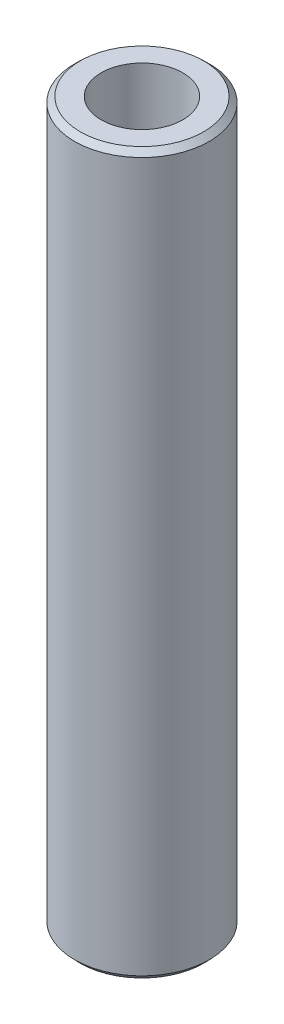
ISO-10303-21;
HEADER;
FILE_DESCRIPTION(('STEP AP214'),'2;1');
FILE_NAME('part.step','',(''),(''),'','','');
FILE_SCHEMA(('AUTOMOTIVE_DESIGN { 1 0 10303 214 1 1 1 1 }'));
ENDSEC;
DATA;
#1=APPLICATION_CONTEXT('core data for automotive mechanical design processes');
#2=APPLICATION_PROTOCOL_DEFINITION('international standard','automotive_design',2000,#1);
#3=PRODUCT_CONTEXT('',#1,'mechanical');
#4=PRODUCT('Part','Part','',(#3));
#5=PRODUCT_RELATED_PRODUCT_CATEGORY('part','',(#4));
#6=PRODUCT_DEFINITION_FORMATION('','',#4);
#7=PRODUCT_DEFINITION_CONTEXT('part definition',#1,'design');
#8=PRODUCT_DEFINITION('design','',#6,#7);
#9=PRODUCT_DEFINITION_SHAPE('','',#8);
#10=(LENGTH_UNIT() NAMED_UNIT(*) SI_UNIT(.MILLI.,.METRE.));
#11=(NAMED_UNIT(*) PLANE_ANGLE_UNIT() SI_UNIT($,.RADIAN.));
#12=(NAMED_UNIT(*) SI_UNIT($,.STERADIAN.) SOLID_ANGLE_UNIT());
#13=UNCERTAINTY_MEASURE_WITH_UNIT(LENGTH_MEASURE(1.E-05),#10,'distance_accuracy_value','');
#14=(GEOMETRIC_REPRESENTATION_CONTEXT(3) GLOBAL_UNCERTAINTY_ASSIGNED_CONTEXT((#13)) GLOBAL_UNIT_ASSIGNED_CONTEXT((#10,
#11,#12)) REPRESENTATION_CONTEXT('',''));
#15=CARTESIAN_POINT('',(0.,0.,0.));
#16=DIRECTION('',(0.,0.,1.));
#17=DIRECTION('',(1.,0.,0.));
#18=AXIS2_PLACEMENT_3D('',#15,#16,#17);
#19=CARTESIAN_POINT('',(0.,587.910503702546,0.));
#20=DIRECTION('',(0.,-1.,0.));
#21=DIRECTION('',(0.,0.,-1.));
#22=AXIS2_PLACEMENT_3D('',#19,#20,#21);
#23=CYLINDRICAL_SURFACE('',#22,55.);
#24=CARTESIAN_POINT('',(0.,583.458838869542,0.));
#25=DIRECTION('',(0.,1.,0.));
#26=DIRECTION('',(0.,0.,1.));
#27=AXIS2_PLACEMENT_3D('',#24,#25,#26);
#28=CIRCLE('',#27,55.);
#29=CARTESIAN_POINT('',(0.,583.458838869542,55.));
#30=VERTEX_POINT('',#29);
#31=EDGE_CURVE('E50',#30,#30,#28,.F.);
#32=ORIENTED_EDGE('',*,*,#31,.T.);
#33=EDGE_LOOP('',(#32));
#34=FACE_BOUND('',#33,.T.);
#35=CARTESIAN_POINT('',(0.,4.67271914538614,0.));
#36=DIRECTION('',(0.,1.,0.));
#37=DIRECTION('',(0.,0.,1.));
#38=AXIS2_PLACEMENT_3D('',#35,#36,#37);
#39=CIRCLE('',#38,55.);
#40=CARTESIAN_POINT('',(0.,4.67271914538614,55.));
#41=VERTEX_POINT('',#40);
#42=EDGE_CURVE('E51',#41,#41,#39,.T.);
#43=ORIENTED_EDGE('',*,*,#42,.T.);
#44=EDGE_LOOP('',(#43));
#45=FACE_BOUND('',#44,.T.);
#46=ADVANCED_FACE('F39',(#34,#45),#23,.T.);
#47=CARTESIAN_POINT('',(0.,587.910503702546,0.));
#48=DIRECTION('',(0.,1.,0.));
#49=DIRECTION('',(0.,0.,1.));
#50=AXIS2_PLACEMENT_3D('',#47,#48,#49);
#51=PLANE('',#50);
#52=CARTESIAN_POINT('',(0.,587.910503702546,0.));
#53=DIRECTION('',(0.,1.,0.));
#54=DIRECTION('',(0.,0.,1.));
#55=AXIS2_PLACEMENT_3D('',#52,#53,#54);
#56=CIRCLE('',#55,50.3272808546136);
#57=CARTESIAN_POINT('',(0.,587.910503702546,50.3272808546136));
#58=VERTEX_POINT('',#57);
#59=EDGE_CURVE('E54',#58,#58,#56,.T.);
#60=ORIENTED_EDGE('',*,*,#59,.T.);
#61=EDGE_LOOP('',(#60));
#62=FACE_BOUND('',#61,.T.);
#63=CARTESIAN_POINT('',(0.,587.910503702546,0.));
#64=DIRECTION('',(0.,1.,0.));
#65=DIRECTION('',(0.,0.,1.));
#66=AXIS2_PLACEMENT_3D('',#63,#64,#65);
#67=CIRCLE('',#66,33.3338103617702);
#68=CARTESIAN_POINT('',(0.,587.910503702546,33.3338103617702));
#69=VERTEX_POINT('',#68);
#70=EDGE_CURVE('E58',#69,#69,#67,.T.);
#71=ORIENTED_EDGE('',*,*,#70,.F.);
#72=EDGE_LOOP('',(#71));
#73=FACE_BOUND('',#72,.T.);
#74=ADVANCED_FACE('F69',(#62,#73),#51,.T.);
#75=CARTESIAN_POINT('',(0.,0.,0.));
#76=DIRECTION('',(0.,1.,0.));
#77=DIRECTION('',(0.,0.,1.));
#78=AXIS2_PLACEMENT_3D('',#75,#76,#77);
#79=PLANE('',#78);
#80=CARTESIAN_POINT('',(0.,0.,0.));
#81=DIRECTION('',(0.,1.,0.));
#82=DIRECTION('',(0.,0.,1.));
#83=AXIS2_PLACEMENT_3D('',#80,#81,#82);
#84=CIRCLE('',#83,50.5483351669968);
#85=CARTESIAN_POINT('',(0.,0.,50.5483351669968));
#86=VERTEX_POINT('',#85);
#87=EDGE_CURVE('E10',#86,#86,#84,.F.);
#88=ORIENTED_EDGE('',*,*,#87,.T.);
#89=EDGE_LOOP('',(#88));
#90=FACE_BOUND('',#89,.T.);
#91=CARTESIAN_POINT('',(0.,0.,0.));
#92=DIRECTION('',(0.,1.,0.));
#93=DIRECTION('',(0.,0.,1.));
#94=AXIS2_PLACEMENT_3D('',#91,#92,#93);
#95=CIRCLE('',#94,33.3338103617702);
#96=CARTESIAN_POINT('',(0.,0.,33.3338103617702));
#97=VERTEX_POINT('',#96);
#98=EDGE_CURVE('E63',#97,#97,#95,.T.);
#99=ORIENTED_EDGE('',*,*,#98,.T.);
#100=EDGE_LOOP('',(#99));
#101=FACE_BOUND('',#100,.T.);
#102=ADVANCED_FACE('F75',(#90,#101),#79,.F.);
#103=CARTESIAN_POINT('',(0.,587.910503702546,0.));
#104=DIRECTION('',(0.,-1.,0.));
#105=DIRECTION('',(0.,0.,-1.));
#106=AXIS2_PLACEMENT_3D('',#103,#104,#105);
#107=CYLINDRICAL_SURFACE('',#106,33.3338103617702);
#108=ORIENTED_EDGE('',*,*,#70,.T.);
#109=EDGE_LOOP('',(#108));
#110=FACE_BOUND('',#109,.T.);
#111=ORIENTED_EDGE('',*,*,#98,.F.);
#112=EDGE_LOOP('',(#111));
#113=FACE_BOUND('',#112,.T.);
#114=ADVANCED_FACE('F70',(#110,#113),#107,.F.);
#115=CARTESIAN_POINT('',(0.,587.910503702546,0.));
#116=DIRECTION('',(0.,-1.,0.));
#117=DIRECTION('',(0.,0.,-1.));
#118=AXIS2_PLACEMENT_3D('',#115,#116,#117);
#119=CONICAL_SURFACE('',#118,50.3272808546136,0.80962019086505);
#120=ORIENTED_EDGE('',*,*,#31,.F.);
#121=EDGE_LOOP('',(#120));
#122=FACE_BOUND('',#121,.T.);
#123=ORIENTED_EDGE('',*,*,#59,.F.);
#124=EDGE_LOOP('',(#123));
#125=FACE_BOUND('',#124,.T.);
#126=ADVANCED_FACE('F81',(#122,#125),#119,.T.);
#127=CARTESIAN_POINT('',(0.,4.67271914538614,0.));
#128=DIRECTION('',(0.,1.,0.));
#129=DIRECTION('',(0.,0.,1.));
#130=AXIS2_PLACEMENT_3D('',#127,#128,#129);
#131=CONICAL_SURFACE('',#130,55.,0.761176135929847);
#132=ORIENTED_EDGE('',*,*,#87,.F.);
#133=EDGE_LOOP('',(#132));
#134=FACE_BOUND('',#133,.T.);
#135=ORIENTED_EDGE('',*,*,#42,.F.);
#136=EDGE_LOOP('',(#135));
#137=FACE_BOUND('',#136,.T.);
#138=ADVANCED_FACE('F45',(#134,#137),#131,.T.);
#139=CLOSED_SHELL('',(#46,#74,#102,#114,#126,#138));
#140=MANIFOLD_SOLID_BREP('B2',#139);
#141=ADVANCED_BREP_SHAPE_REPRESENTATION('',(#18,#140),#14);
#142=SHAPE_DEFINITION_REPRESENTATION(#9,#141);
ENDSEC;
END-ISO-10303-21;
